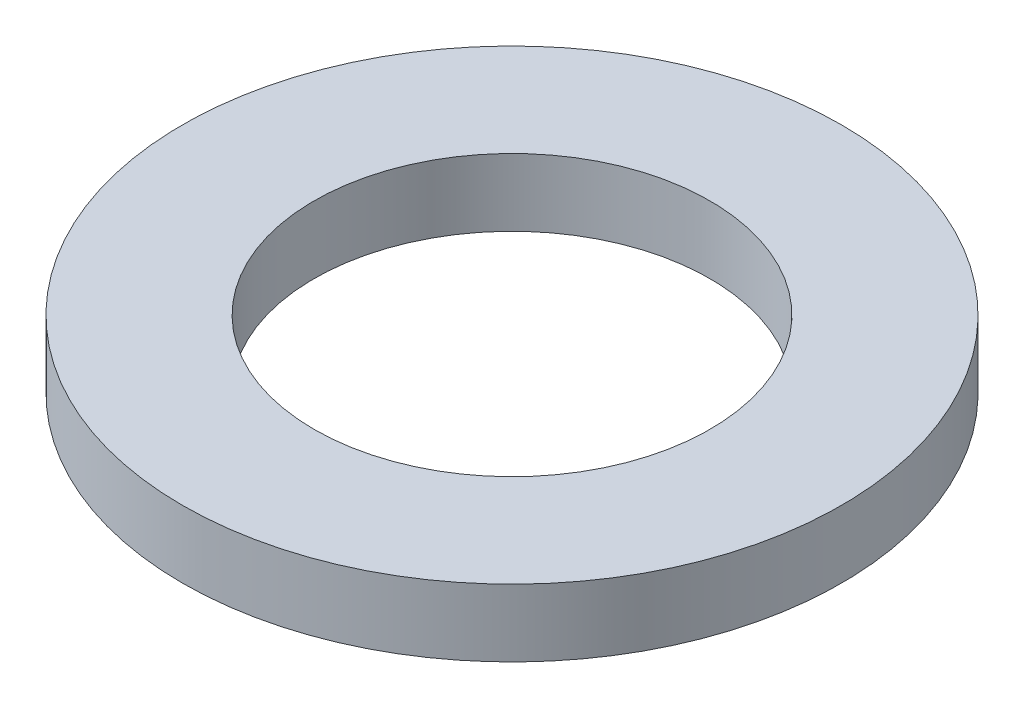
ISO-10303-21;
HEADER;
FILE_DESCRIPTION(('STEP AP214'),'2;1');
FILE_NAME('part.step','',(''),(''),'','','');
FILE_SCHEMA(('AUTOMOTIVE_DESIGN { 1 0 10303 214 1 1 1 1 }'));
ENDSEC;
DATA;
#1=APPLICATION_CONTEXT('core data for automotive mechanical design processes');
#2=APPLICATION_PROTOCOL_DEFINITION('international standard','automotive_design',2000,#1);
#3=PRODUCT_CONTEXT('',#1,'mechanical');
#4=PRODUCT('Part','Part','',(#3));
#5=PRODUCT_RELATED_PRODUCT_CATEGORY('part','',(#4));
#6=PRODUCT_DEFINITION_FORMATION('','',#4);
#7=PRODUCT_DEFINITION_CONTEXT('part definition',#1,'design');
#8=PRODUCT_DEFINITION('design','',#6,#7);
#9=PRODUCT_DEFINITION_SHAPE('','',#8);
#10=(LENGTH_UNIT() NAMED_UNIT(*) SI_UNIT(.MILLI.,.METRE.));
#11=(NAMED_UNIT(*) PLANE_ANGLE_UNIT() SI_UNIT($,.RADIAN.));
#12=(NAMED_UNIT(*) SI_UNIT($,.STERADIAN.) SOLID_ANGLE_UNIT());
#13=UNCERTAINTY_MEASURE_WITH_UNIT(LENGTH_MEASURE(1.E-05),#10,'distance_accuracy_value','');
#14=(GEOMETRIC_REPRESENTATION_CONTEXT(3) GLOBAL_UNCERTAINTY_ASSIGNED_CONTEXT((#13)) GLOBAL_UNIT_ASSIGNED_CONTEXT((#10,
#11,#12)) REPRESENTATION_CONTEXT('',''));
#15=CARTESIAN_POINT('',(0.,0.,0.));
#16=DIRECTION('',(0.,0.,1.));
#17=DIRECTION('',(1.,0.,0.));
#18=AXIS2_PLACEMENT_3D('',#15,#16,#17);
#19=CARTESIAN_POINT('',(0.,0.812800000000002,0.));
#20=DIRECTION('',(0.,1.,0.));
#21=DIRECTION('',(0.,0.,1.));
#22=AXIS2_PLACEMENT_3D('',#19,#20,#21);
#23=PLANE('',#22);
#24=CARTESIAN_POINT('',(0.,0.812800000000002,0.));
#25=DIRECTION('',(0.,1.,0.));
#26=DIRECTION('',(0.,0.,1.));
#27=AXIS2_PLACEMENT_3D('',#24,#25,#26);
#28=CIRCLE('',#27,3.9751);
#29=CARTESIAN_POINT('',(0.,0.812800000000002,3.9751));
#30=VERTEX_POINT('',#29);
#31=EDGE_CURVE('E12',#30,#30,#28,.T.);
#32=ORIENTED_EDGE('',*,*,#31,.T.);
#33=EDGE_LOOP('',(#32));
#34=FACE_BOUND('',#33,.T.);
#35=CARTESIAN_POINT('',(0.,0.812800000000002,0.));
#36=DIRECTION('',(0.,1.,0.));
#37=DIRECTION('',(0.,0.,1.));
#38=AXIS2_PLACEMENT_3D('',#35,#36,#37);
#39=CIRCLE('',#38,2.3876);
#40=CARTESIAN_POINT('',(0.,0.812800000000002,2.3876));
#41=VERTEX_POINT('',#40);
#42=EDGE_CURVE('E53',#41,#41,#39,.T.);
#43=ORIENTED_EDGE('',*,*,#42,.F.);
#44=EDGE_LOOP('',(#43));
#45=FACE_BOUND('',#44,.T.);
#46=ADVANCED_FACE('F42',(#34,#45),#23,.T.);
#47=CARTESIAN_POINT('',(0.,0.,0.));
#48=DIRECTION('',(0.,1.,0.));
#49=DIRECTION('',(0.,0.,1.));
#50=AXIS2_PLACEMENT_3D('',#47,#48,#49);
#51=PLANE('',#50);
#52=CARTESIAN_POINT('',(0.,0.,0.));
#53=DIRECTION('',(0.,1.,0.));
#54=DIRECTION('',(0.,0.,1.));
#55=AXIS2_PLACEMENT_3D('',#52,#53,#54);
#56=CIRCLE('',#55,3.9751);
#57=CARTESIAN_POINT('',(0.,0.,3.9751));
#58=VERTEX_POINT('',#57);
#59=EDGE_CURVE('E46',#58,#58,#56,.T.);
#60=ORIENTED_EDGE('',*,*,#59,.F.);
#61=EDGE_LOOP('',(#60));
#62=FACE_BOUND('',#61,.T.);
#63=CARTESIAN_POINT('',(0.,0.,0.));
#64=DIRECTION('',(0.,1.,0.));
#65=DIRECTION('',(0.,0.,1.));
#66=AXIS2_PLACEMENT_3D('',#63,#64,#65);
#67=CIRCLE('',#66,2.3876);
#68=CARTESIAN_POINT('',(0.,0.,2.3876));
#69=VERTEX_POINT('',#68);
#70=EDGE_CURVE('E55',#69,#69,#67,.T.);
#71=ORIENTED_EDGE('',*,*,#70,.T.);
#72=EDGE_LOOP('',(#71));
#73=FACE_BOUND('',#72,.T.);
#74=ADVANCED_FACE('F65',(#62,#73),#51,.F.);
#75=CARTESIAN_POINT('',(0.,0.812800000000002,0.));
#76=DIRECTION('',(0.,-1.,0.));
#77=DIRECTION('',(0.,0.,-1.));
#78=AXIS2_PLACEMENT_3D('',#75,#76,#77);
#79=CYLINDRICAL_SURFACE('',#78,3.9751);
#80=ORIENTED_EDGE('',*,*,#31,.F.);
#81=EDGE_LOOP('',(#80));
#82=FACE_BOUND('',#81,.T.);
#83=ORIENTED_EDGE('',*,*,#59,.T.);
#84=EDGE_LOOP('',(#83));
#85=FACE_BOUND('',#84,.T.);
#86=ADVANCED_FACE('F44',(#82,#85),#79,.T.);
#87=CARTESIAN_POINT('',(0.,0.812800000000002,0.));
#88=DIRECTION('',(0.,-1.,0.));
#89=DIRECTION('',(0.,0.,-1.));
#90=AXIS2_PLACEMENT_3D('',#87,#88,#89);
#91=CYLINDRICAL_SURFACE('',#90,2.3876);
#92=ORIENTED_EDGE('',*,*,#42,.T.);
#93=EDGE_LOOP('',(#92));
#94=FACE_BOUND('',#93,.T.);
#95=ORIENTED_EDGE('',*,*,#70,.F.);
#96=EDGE_LOOP('',(#95));
#97=FACE_BOUND('',#96,.T.);
#98=ADVANCED_FACE('F61',(#94,#97),#91,.F.);
#99=CLOSED_SHELL('',(#46,#74,#86,#98));
#100=MANIFOLD_SOLID_BREP('B2',#99);
#101=ADVANCED_BREP_SHAPE_REPRESENTATION('',(#18,#100),#14);
#102=SHAPE_DEFINITION_REPRESENTATION(#9,#101);
ENDSEC;
END-ISO-10303-21;
